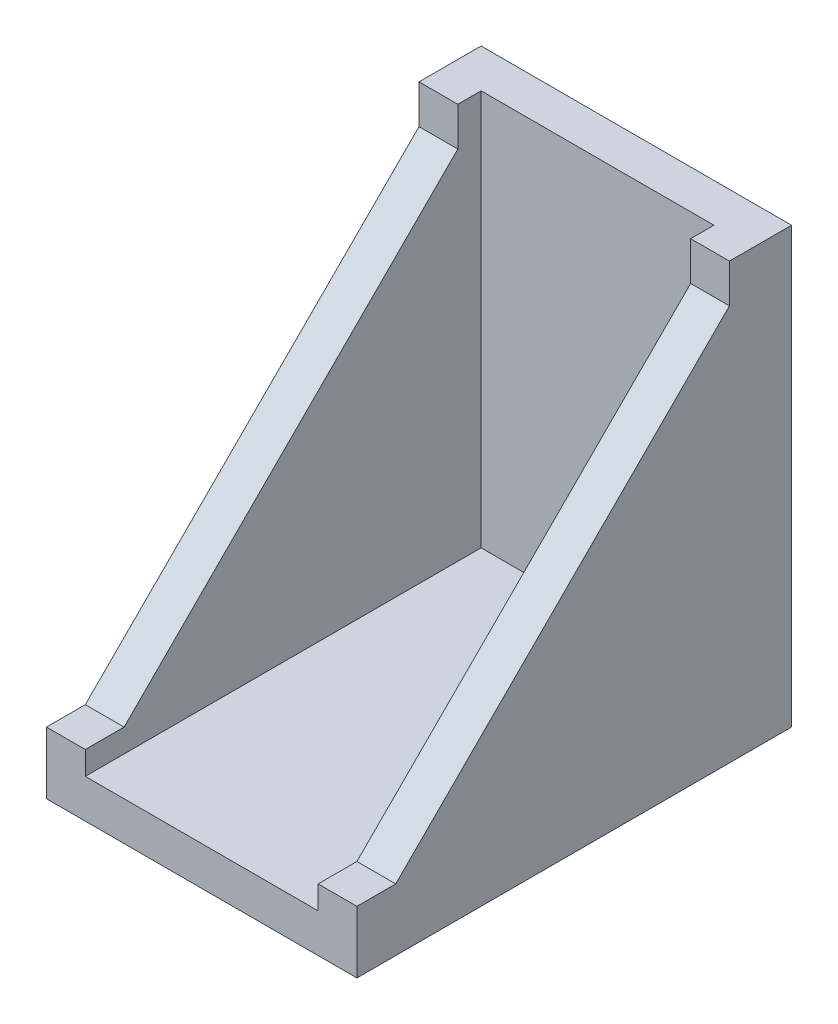
ISO-10303-21;
HEADER;
FILE_DESCRIPTION(('STEP AP214'),'2;1');
FILE_NAME('part.step','',(''),(''),'','','');
FILE_SCHEMA(('AUTOMOTIVE_DESIGN { 1 0 10303 214 1 1 1 1 }'));
ENDSEC;
DATA;
#1=APPLICATION_CONTEXT('core data for automotive mechanical design processes');
#2=APPLICATION_PROTOCOL_DEFINITION('international standard','automotive_design',2000,#1);
#3=PRODUCT_CONTEXT('',#1,'mechanical');
#4=PRODUCT('Part','Part','',(#3));
#5=PRODUCT_RELATED_PRODUCT_CATEGORY('part','',(#4));
#6=PRODUCT_DEFINITION_FORMATION('','',#4);
#7=PRODUCT_DEFINITION_CONTEXT('part definition',#1,'design');
#8=PRODUCT_DEFINITION('design','',#6,#7);
#9=PRODUCT_DEFINITION_SHAPE('','',#8);
#10=(LENGTH_UNIT() NAMED_UNIT(*) SI_UNIT(.MILLI.,.METRE.));
#11=(NAMED_UNIT(*) PLANE_ANGLE_UNIT() SI_UNIT($,.RADIAN.));
#12=(NAMED_UNIT(*) SI_UNIT($,.STERADIAN.) SOLID_ANGLE_UNIT());
#13=UNCERTAINTY_MEASURE_WITH_UNIT(LENGTH_MEASURE(1.E-05),#10,'distance_accuracy_value','');
#14=(GEOMETRIC_REPRESENTATION_CONTEXT(3) GLOBAL_UNCERTAINTY_ASSIGNED_CONTEXT((#13)) GLOBAL_UNIT_ASSIGNED_CONTEXT((#10,
#11,#12)) REPRESENTATION_CONTEXT('',''));
#15=CARTESIAN_POINT('',(0.,0.,0.));
#16=DIRECTION('',(0.,0.,1.));
#17=DIRECTION('',(1.,0.,0.));
#18=AXIS2_PLACEMENT_3D('',#15,#16,#17);
#19=CARTESIAN_POINT('',(0.,28.,0.));
#20=DIRECTION('',(1.,0.,0.));
#21=DIRECTION('',(0.,0.,-1.));
#22=AXIS2_PLACEMENT_3D('',#19,#20,#21);
#23=PLANE('',#22);
#24=DIRECTION('',(0.,1.,0.));
#25=VECTOR('',#24,1.);
#26=CARTESIAN_POINT('',(0.,28.,4.));
#27=LINE('',#26,#25);
#28=CARTESIAN_POINT('',(0.,25.5,4.));
#29=VERTEX_POINT('',#28);
#30=CARTESIAN_POINT('',(0.,28.,4.));
#31=VERTEX_POINT('',#30);
#32=EDGE_CURVE('E229',#29,#31,#27,.T.);
#33=ORIENTED_EDGE('',*,*,#32,.T.);
#34=DIRECTION('',(0.,0.,1.));
#35=VECTOR('',#34,1.);
#36=CARTESIAN_POINT('',(0.,28.,0.));
#37=LINE('',#36,#35);
#38=CARTESIAN_POINT('',(0.,28.,0.));
#39=VERTEX_POINT('',#38);
#40=EDGE_CURVE('E159',#39,#31,#37,.T.);
#41=ORIENTED_EDGE('',*,*,#40,.F.);
#42=DIRECTION('',(0.,-1.,0.));
#43=VECTOR('',#42,1.);
#44=CARTESIAN_POINT('',(0.,28.,0.));
#45=LINE('',#44,#43);
#46=CARTESIAN_POINT('',(0.,0.,0.));
#47=VERTEX_POINT('',#46);
#48=EDGE_CURVE('E192',#39,#47,#45,.T.);
#49=ORIENTED_EDGE('',*,*,#48,.T.);
#50=DIRECTION('',(0.,0.,1.));
#51=VECTOR('',#50,1.);
#52=CARTESIAN_POINT('',(0.,0.,0.));
#53=LINE('',#52,#51);
#54=CARTESIAN_POINT('',(0.,0.,28.));
#55=VERTEX_POINT('',#54);
#56=EDGE_CURVE('E176',#47,#55,#53,.T.);
#57=ORIENTED_EDGE('',*,*,#56,.T.);
#58=DIRECTION('',(0.,-1.,0.));
#59=VECTOR('',#58,1.);
#60=CARTESIAN_POINT('',(0.,28.,28.));
#61=LINE('',#60,#59);
#62=CARTESIAN_POINT('',(0.,4.,28.));
#63=VERTEX_POINT('',#62);
#64=EDGE_CURVE('E11',#63,#55,#61,.T.);
#65=ORIENTED_EDGE('',*,*,#64,.F.);
#66=DIRECTION('',(0.,0.,-1.));
#67=VECTOR('',#66,1.);
#68=CARTESIAN_POINT('',(0.,4.,25.5000000000001));
#69=LINE('',#68,#67);
#70=CARTESIAN_POINT('',(0.,4.,25.5000000000001));
#71=VERTEX_POINT('',#70);
#72=EDGE_CURVE('E149',#63,#71,#69,.T.);
#73=ORIENTED_EDGE('',*,*,#72,.T.);
#74=DIRECTION('',(0.,0.707106781186546,-0.707106781186549));
#75=VECTOR('',#74,1.);
#76=CARTESIAN_POINT('',(0.,25.5,4.));
#77=LINE('',#76,#75);
#78=EDGE_CURVE('E231',#71,#29,#77,.T.);
#79=ORIENTED_EDGE('',*,*,#78,.T.);
#80=EDGE_LOOP('',(#33,#41,#49,#57,#65,#73,#79));
#81=FACE_BOUND('',#80,.T.);
#82=ADVANCED_FACE('F39',(#81),#23,.F.);
#83=CARTESIAN_POINT('',(0.,28.,28.));
#84=DIRECTION('',(0.,0.,-1.));
#85=DIRECTION('',(-1.,0.,0.));
#86=AXIS2_PLACEMENT_3D('',#83,#84,#85);
#87=PLANE('',#86);
#88=DIRECTION('',(1.,0.,0.));
#89=VECTOR('',#88,1.);
#90=CARTESIAN_POINT('',(-0.000999999999999265,4.,28.));
#91=LINE('',#90,#89);
#92=CARTESIAN_POINT('',(2.5,4.,28.));
#93=VERTEX_POINT('',#92);
#94=EDGE_CURVE('E53',#63,#93,#91,.T.);
#95=ORIENTED_EDGE('',*,*,#94,.F.);
#96=ORIENTED_EDGE('',*,*,#64,.T.);
#97=DIRECTION('',(1.,0.,0.));
#98=VECTOR('',#97,1.);
#99=CARTESIAN_POINT('',(0.,0.,28.));
#100=LINE('',#99,#98);
#101=CARTESIAN_POINT('',(20.,0.,28.));
#102=VERTEX_POINT('',#101);
#103=EDGE_CURVE('E195',#55,#102,#100,.T.);
#104=ORIENTED_EDGE('',*,*,#103,.T.);
#105=DIRECTION('',(0.,-1.,0.));
#106=VECTOR('',#105,1.);
#107=CARTESIAN_POINT('',(20.,28.,28.));
#108=LINE('',#107,#106);
#109=CARTESIAN_POINT('',(20.,4.,28.));
#110=VERTEX_POINT('',#109);
#111=EDGE_CURVE('E46',#110,#102,#108,.T.);
#112=ORIENTED_EDGE('',*,*,#111,.F.);
#113=DIRECTION('',(-1.,0.,0.));
#114=VECTOR('',#113,1.);
#115=CARTESIAN_POINT('',(20.001,4.,28.));
#116=LINE('',#115,#114);
#117=CARTESIAN_POINT('',(17.5,4.,28.));
#118=VERTEX_POINT('',#117);
#119=EDGE_CURVE('E245',#110,#118,#116,.T.);
#120=ORIENTED_EDGE('',*,*,#119,.T.);
#121=DIRECTION('',(0.,1.,0.));
#122=VECTOR('',#121,1.);
#123=CARTESIAN_POINT('',(17.5,2.5,28.));
#124=LINE('',#123,#122);
#125=CARTESIAN_POINT('',(17.5,2.5,28.));
#126=VERTEX_POINT('',#125);
#127=EDGE_CURVE('E180',#126,#118,#124,.T.);
#128=ORIENTED_EDGE('',*,*,#127,.F.);
#129=DIRECTION('',(1.,0.,0.));
#130=VECTOR('',#129,1.);
#131=CARTESIAN_POINT('',(2.5,2.5,28.));
#132=LINE('',#131,#130);
#133=CARTESIAN_POINT('',(2.5,2.5,28.));
#134=VERTEX_POINT('',#133);
#135=EDGE_CURVE('E264',#134,#126,#132,.T.);
#136=ORIENTED_EDGE('',*,*,#135,.F.);
#137=DIRECTION('',(0.,1.,0.));
#138=VECTOR('',#137,1.);
#139=CARTESIAN_POINT('',(2.5,2.5,28.));
#140=LINE('',#139,#138);
#141=EDGE_CURVE('E183',#134,#93,#140,.T.);
#142=ORIENTED_EDGE('',*,*,#141,.T.);
#143=EDGE_LOOP('',(#95,#96,#104,#112,#120,#128,#136,#142));
#144=FACE_BOUND('',#143,.T.);
#145=ADVANCED_FACE('F217',(#144),#87,.F.);
#146=CARTESIAN_POINT('',(0.,28.,0.));
#147=DIRECTION('',(0.,1.,0.));
#148=DIRECTION('',(0.,0.,1.));
#149=AXIS2_PLACEMENT_3D('',#146,#147,#148);
#150=PLANE('',#149);
#151=ORIENTED_EDGE('',*,*,#40,.T.);
#152=DIRECTION('',(1.,0.,0.));
#153=VECTOR('',#152,1.);
#154=CARTESIAN_POINT('',(-0.000999999999999265,28.,4.));
#155=LINE('',#154,#153);
#156=CARTESIAN_POINT('',(2.5,28.,4.));
#157=VERTEX_POINT('',#156);
#158=EDGE_CURVE('E142',#31,#157,#155,.T.);
#159=ORIENTED_EDGE('',*,*,#158,.T.);
#160=DIRECTION('',(0.,0.,1.));
#161=VECTOR('',#160,1.);
#162=CARTESIAN_POINT('',(2.5,28.,28.));
#163=LINE('',#162,#161);
#164=CARTESIAN_POINT('',(2.5,28.,2.5));
#165=VERTEX_POINT('',#164);
#166=EDGE_CURVE('E157',#165,#157,#163,.T.);
#167=ORIENTED_EDGE('',*,*,#166,.F.);
#168=DIRECTION('',(-1.,0.,0.));
#169=VECTOR('',#168,1.);
#170=CARTESIAN_POINT('',(2.5,28.,2.5));
#171=LINE('',#170,#169);
#172=CARTESIAN_POINT('',(17.5,28.,2.5));
#173=VERTEX_POINT('',#172);
#174=EDGE_CURVE('E167',#173,#165,#171,.T.);
#175=ORIENTED_EDGE('',*,*,#174,.F.);
#176=DIRECTION('',(0.,0.,-1.));
#177=VECTOR('',#176,1.);
#178=CARTESIAN_POINT('',(17.5,28.,28.));
#179=LINE('',#178,#177);
#180=CARTESIAN_POINT('',(17.5,28.,4.));
#181=VERTEX_POINT('',#180);
#182=EDGE_CURVE('E165',#181,#173,#179,.T.);
#183=ORIENTED_EDGE('',*,*,#182,.F.);
#184=DIRECTION('',(-1.,0.,0.));
#185=VECTOR('',#184,1.);
#186=CARTESIAN_POINT('',(20.001,28.,4.));
#187=LINE('',#186,#185);
#188=CARTESIAN_POINT('',(20.,28.,4.));
#189=VERTEX_POINT('',#188);
#190=EDGE_CURVE('E61',#189,#181,#187,.T.);
#191=ORIENTED_EDGE('',*,*,#190,.F.);
#192=DIRECTION('',(0.,0.,-1.));
#193=VECTOR('',#192,1.);
#194=CARTESIAN_POINT('',(20.,28.,0.));
#195=LINE('',#194,#193);
#196=CARTESIAN_POINT('',(20.,28.,0.));
#197=VERTEX_POINT('',#196);
#198=EDGE_CURVE('E187',#189,#197,#195,.T.);
#199=ORIENTED_EDGE('',*,*,#198,.T.);
#200=DIRECTION('',(-1.,0.,0.));
#201=VECTOR('',#200,1.);
#202=CARTESIAN_POINT('',(0.,28.,0.));
#203=LINE('',#202,#201);
#204=EDGE_CURVE('E190',#197,#39,#203,.T.);
#205=ORIENTED_EDGE('',*,*,#204,.T.);
#206=EDGE_LOOP('',(#151,#159,#167,#175,#183,#191,#199,#205));
#207=FACE_BOUND('',#206,.T.);
#208=ADVANCED_FACE('F155',(#207),#150,.T.);
#209=CARTESIAN_POINT('',(2.5,2.5,28.));
#210=DIRECTION('',(-1.,0.,0.));
#211=DIRECTION('',(0.,0.,1.));
#212=AXIS2_PLACEMENT_3D('',#209,#210,#211);
#213=PLANE('',#212);
#214=DIRECTION('',(0.,-1.,0.));
#215=VECTOR('',#214,1.);
#216=CARTESIAN_POINT('',(2.5,28.,4.));
#217=LINE('',#216,#215);
#218=CARTESIAN_POINT('',(2.5,25.5,4.));
#219=VERTEX_POINT('',#218);
#220=EDGE_CURVE('E139',#157,#219,#217,.T.);
#221=ORIENTED_EDGE('',*,*,#220,.T.);
#222=DIRECTION('',(0.,-0.707106781186546,0.707106781186549));
#223=VECTOR('',#222,1.);
#224=CARTESIAN_POINT('',(2.5,25.5,4.));
#225=LINE('',#224,#223);
#226=CARTESIAN_POINT('',(2.5,4.,25.5000000000001));
#227=VERTEX_POINT('',#226);
#228=EDGE_CURVE('E150',#219,#227,#225,.T.);
#229=ORIENTED_EDGE('',*,*,#228,.T.);
#230=DIRECTION('',(0.,0.,1.));
#231=VECTOR('',#230,1.);
#232=CARTESIAN_POINT('',(2.5,4.,25.5000000000001));
#233=LINE('',#232,#231);
#234=EDGE_CURVE('E261',#227,#93,#233,.T.);
#235=ORIENTED_EDGE('',*,*,#234,.T.);
#236=ORIENTED_EDGE('',*,*,#141,.F.);
#237=DIRECTION('',(0.,0.,1.));
#238=VECTOR('',#237,1.);
#239=CARTESIAN_POINT('',(2.5,2.5,28.));
#240=LINE('',#239,#238);
#241=CARTESIAN_POINT('',(2.5,2.5,2.5));
#242=VERTEX_POINT('',#241);
#243=EDGE_CURVE('E174',#242,#134,#240,.T.);
#244=ORIENTED_EDGE('',*,*,#243,.F.);
#245=DIRECTION('',(0.,1.,0.));
#246=VECTOR('',#245,1.);
#247=CARTESIAN_POINT('',(2.5,2.5,2.5));
#248=LINE('',#247,#246);
#249=EDGE_CURVE('E163',#242,#165,#248,.T.);
#250=ORIENTED_EDGE('',*,*,#249,.T.);
#251=ORIENTED_EDGE('',*,*,#166,.T.);
#252=EDGE_LOOP('',(#221,#229,#235,#236,#244,#250,#251));
#253=FACE_BOUND('',#252,.T.);
#254=ADVANCED_FACE('F161',(#253),#213,.F.);
#255=CARTESIAN_POINT('',(20.,28.,0.));
#256=DIRECTION('',(-1.,0.,0.));
#257=DIRECTION('',(0.,0.,1.));
#258=AXIS2_PLACEMENT_3D('',#255,#256,#257);
#259=PLANE('',#258);
#260=DIRECTION('',(0.,0.707106781186546,-0.707106781186549));
#261=VECTOR('',#260,1.);
#262=CARTESIAN_POINT('',(20.,25.5,4.));
#263=LINE('',#262,#261);
#264=CARTESIAN_POINT('',(20.,4.,25.5000000000001));
#265=VERTEX_POINT('',#264);
#266=CARTESIAN_POINT('',(20.,25.5,4.));
#267=VERTEX_POINT('',#266);
#268=EDGE_CURVE('E253',#265,#267,#263,.T.);
#269=ORIENTED_EDGE('',*,*,#268,.F.);
#270=DIRECTION('',(0.,0.,-1.));
#271=VECTOR('',#270,1.);
#272=CARTESIAN_POINT('',(20.,4.,25.5000000000001));
#273=LINE('',#272,#271);
#274=EDGE_CURVE('E213',#110,#265,#273,.T.);
#275=ORIENTED_EDGE('',*,*,#274,.F.);
#276=ORIENTED_EDGE('',*,*,#111,.T.);
#277=DIRECTION('',(0.,0.,-1.));
#278=VECTOR('',#277,1.);
#279=CARTESIAN_POINT('',(20.,0.,0.));
#280=LINE('',#279,#278);
#281=CARTESIAN_POINT('',(20.,0.,0.));
#282=VERTEX_POINT('',#281);
#283=EDGE_CURVE('E198',#102,#282,#280,.T.);
#284=ORIENTED_EDGE('',*,*,#283,.T.);
#285=DIRECTION('',(0.,-1.,0.));
#286=VECTOR('',#285,1.);
#287=CARTESIAN_POINT('',(20.,28.,0.));
#288=LINE('',#287,#286);
#289=EDGE_CURVE('E203',#197,#282,#288,.T.);
#290=ORIENTED_EDGE('',*,*,#289,.F.);
#291=ORIENTED_EDGE('',*,*,#198,.F.);
#292=DIRECTION('',(0.,1.,0.));
#293=VECTOR('',#292,1.);
#294=CARTESIAN_POINT('',(20.,28.,4.));
#295=LINE('',#294,#293);
#296=EDGE_CURVE('E241',#267,#189,#295,.T.);
#297=ORIENTED_EDGE('',*,*,#296,.F.);
#298=EDGE_LOOP('',(#269,#275,#276,#284,#290,#291,#297));
#299=FACE_BOUND('',#298,.T.);
#300=ADVANCED_FACE('F209',(#299),#259,.F.);
#301=CARTESIAN_POINT('',(0.,28.,0.));
#302=DIRECTION('',(0.,0.,1.));
#303=DIRECTION('',(1.,0.,0.));
#304=AXIS2_PLACEMENT_3D('',#301,#302,#303);
#305=PLANE('',#304);
#306=DIRECTION('',(-1.,0.,0.));
#307=VECTOR('',#306,1.);
#308=CARTESIAN_POINT('',(0.,0.,0.));
#309=LINE('',#308,#307);
#310=EDGE_CURVE('E188',#282,#47,#309,.T.);
#311=ORIENTED_EDGE('',*,*,#310,.T.);
#312=ORIENTED_EDGE('',*,*,#48,.F.);
#313=ORIENTED_EDGE('',*,*,#204,.F.);
#314=ORIENTED_EDGE('',*,*,#289,.T.);
#315=EDGE_LOOP('',(#311,#312,#313,#314));
#316=FACE_BOUND('',#315,.T.);
#317=ADVANCED_FACE('F225',(#316),#305,.F.);
#318=CARTESIAN_POINT('',(0.,0.,0.));
#319=DIRECTION('',(0.,1.,0.));
#320=DIRECTION('',(0.,0.,1.));
#321=AXIS2_PLACEMENT_3D('',#318,#319,#320);
#322=PLANE('',#321);
#323=ORIENTED_EDGE('',*,*,#56,.F.);
#324=ORIENTED_EDGE('',*,*,#310,.F.);
#325=ORIENTED_EDGE('',*,*,#283,.F.);
#326=ORIENTED_EDGE('',*,*,#103,.F.);
#327=EDGE_LOOP('',(#323,#324,#325,#326));
#328=FACE_BOUND('',#327,.T.);
#329=ADVANCED_FACE('F222',(#328),#322,.F.);
#330=CARTESIAN_POINT('',(2.5,2.5,2.5));
#331=DIRECTION('',(0.,0.,-1.));
#332=DIRECTION('',(-1.,0.,0.));
#333=AXIS2_PLACEMENT_3D('',#330,#331,#332);
#334=PLANE('',#333);
#335=ORIENTED_EDGE('',*,*,#174,.T.);
#336=ORIENTED_EDGE('',*,*,#249,.F.);
#337=DIRECTION('',(-1.,0.,0.));
#338=VECTOR('',#337,1.);
#339=CARTESIAN_POINT('',(2.5,2.5,2.5));
#340=LINE('',#339,#338);
#341=CARTESIAN_POINT('',(17.5,2.5,2.5));
#342=VERTEX_POINT('',#341);
#343=EDGE_CURVE('E170',#342,#242,#340,.T.);
#344=ORIENTED_EDGE('',*,*,#343,.F.);
#345=DIRECTION('',(0.,1.,0.));
#346=VECTOR('',#345,1.);
#347=CARTESIAN_POINT('',(17.5,2.5,2.5));
#348=LINE('',#347,#346);
#349=EDGE_CURVE('E177',#342,#173,#348,.T.);
#350=ORIENTED_EDGE('',*,*,#349,.T.);
#351=EDGE_LOOP('',(#335,#336,#344,#350));
#352=FACE_BOUND('',#351,.T.);
#353=ADVANCED_FACE('F274',(#352),#334,.F.);
#354=CARTESIAN_POINT('',(17.5,2.5,28.));
#355=DIRECTION('',(1.,0.,0.));
#356=DIRECTION('',(0.,0.,-1.));
#357=AXIS2_PLACEMENT_3D('',#354,#355,#356);
#358=PLANE('',#357);
#359=ORIENTED_EDGE('',*,*,#127,.T.);
#360=DIRECTION('',(0.,0.,1.));
#361=VECTOR('',#360,1.);
#362=CARTESIAN_POINT('',(17.5,4.,25.5000000000001));
#363=LINE('',#362,#361);
#364=CARTESIAN_POINT('',(17.5,4.,25.5000000000001));
#365=VERTEX_POINT('',#364);
#366=EDGE_CURVE('E256',#365,#118,#363,.T.);
#367=ORIENTED_EDGE('',*,*,#366,.F.);
#368=DIRECTION('',(0.,-0.707106781186546,0.707106781186549));
#369=VECTOR('',#368,1.);
#370=CARTESIAN_POINT('',(17.5,25.5,4.));
#371=LINE('',#370,#369);
#372=CARTESIAN_POINT('',(17.5,25.5,4.));
#373=VERTEX_POINT('',#372);
#374=EDGE_CURVE('E258',#373,#365,#371,.T.);
#375=ORIENTED_EDGE('',*,*,#374,.F.);
#376=DIRECTION('',(0.,-1.,0.));
#377=VECTOR('',#376,1.);
#378=CARTESIAN_POINT('',(17.5,28.,4.));
#379=LINE('',#378,#377);
#380=EDGE_CURVE('E243',#181,#373,#379,.T.);
#381=ORIENTED_EDGE('',*,*,#380,.F.);
#382=ORIENTED_EDGE('',*,*,#182,.T.);
#383=ORIENTED_EDGE('',*,*,#349,.F.);
#384=DIRECTION('',(0.,0.,-1.));
#385=VECTOR('',#384,1.);
#386=CARTESIAN_POINT('',(17.5,2.5,28.));
#387=LINE('',#386,#385);
#388=EDGE_CURVE('E266',#126,#342,#387,.T.);
#389=ORIENTED_EDGE('',*,*,#388,.F.);
#390=EDGE_LOOP('',(#359,#367,#375,#381,#382,#383,#389));
#391=FACE_BOUND('',#390,.T.);
#392=ADVANCED_FACE('F278',(#391),#358,.F.);
#393=CARTESIAN_POINT('',(0.,2.5,0.));
#394=DIRECTION('',(0.,-1.,0.));
#395=DIRECTION('',(0.,0.,-1.));
#396=AXIS2_PLACEMENT_3D('',#393,#394,#395);
#397=PLANE('',#396);
#398=ORIENTED_EDGE('',*,*,#243,.T.);
#399=ORIENTED_EDGE('',*,*,#135,.T.);
#400=ORIENTED_EDGE('',*,*,#388,.T.);
#401=ORIENTED_EDGE('',*,*,#343,.T.);
#402=EDGE_LOOP('',(#398,#399,#400,#401));
#403=FACE_BOUND('',#402,.T.);
#404=ADVANCED_FACE('F271',(#403),#397,.F.);
#405=CARTESIAN_POINT('',(20.001,4.,25.5000000000001));
#406=DIRECTION('',(0.,-1.,0.));
#407=DIRECTION('',(0.,0.,-1.));
#408=AXIS2_PLACEMENT_3D('',#405,#406,#407);
#409=PLANE('',#408);
#410=ORIENTED_EDGE('',*,*,#274,.T.);
#411=DIRECTION('',(-1.,0.,0.));
#412=VECTOR('',#411,1.);
#413=CARTESIAN_POINT('',(20.001,4.,25.5000000000001));
#414=LINE('',#413,#412);
#415=EDGE_CURVE('E249',#265,#365,#414,.T.);
#416=ORIENTED_EDGE('',*,*,#415,.T.);
#417=ORIENTED_EDGE('',*,*,#366,.T.);
#418=ORIENTED_EDGE('',*,*,#119,.F.);
#419=EDGE_LOOP('',(#410,#416,#417,#418));
#420=FACE_BOUND('',#419,.T.);
#421=ADVANCED_FACE('F287',(#420),#409,.F.);
#422=CARTESIAN_POINT('',(20.001,25.5,4.));
#423=DIRECTION('',(0.,-0.707106781186549,-0.707106781186546));
#424=DIRECTION('',(0.,0.707106781186546,-0.707106781186549));
#425=AXIS2_PLACEMENT_3D('',#422,#423,#424);
#426=PLANE('',#425);
#427=ORIENTED_EDGE('',*,*,#268,.T.);
#428=DIRECTION('',(-1.,0.,0.));
#429=VECTOR('',#428,1.);
#430=CARTESIAN_POINT('',(20.001,25.5,4.));
#431=LINE('',#430,#429);
#432=EDGE_CURVE('E247',#267,#373,#431,.T.);
#433=ORIENTED_EDGE('',*,*,#432,.T.);
#434=ORIENTED_EDGE('',*,*,#374,.T.);
#435=ORIENTED_EDGE('',*,*,#415,.F.);
#436=EDGE_LOOP('',(#427,#433,#434,#435));
#437=FACE_BOUND('',#436,.T.);
#438=ADVANCED_FACE('F285',(#437),#426,.F.);
#439=CARTESIAN_POINT('',(20.001,28.,4.));
#440=DIRECTION('',(0.,0.,-1.));
#441=DIRECTION('',(-1.,0.,0.));
#442=AXIS2_PLACEMENT_3D('',#439,#440,#441);
#443=PLANE('',#442);
#444=ORIENTED_EDGE('',*,*,#296,.T.);
#445=ORIENTED_EDGE('',*,*,#190,.T.);
#446=ORIENTED_EDGE('',*,*,#380,.T.);
#447=ORIENTED_EDGE('',*,*,#432,.F.);
#448=EDGE_LOOP('',(#444,#445,#446,#447));
#449=FACE_BOUND('',#448,.T.);
#450=ADVANCED_FACE('F283',(#449),#443,.F.);
#451=CARTESIAN_POINT('',(-0.000999999999999265,28.,4.));
#452=DIRECTION('',(0.,0.,1.));
#453=DIRECTION('',(1.,0.,0.));
#454=AXIS2_PLACEMENT_3D('',#451,#452,#453);
#455=PLANE('',#454);
#456=DIRECTION('',(1.,0.,0.));
#457=VECTOR('',#456,1.);
#458=CARTESIAN_POINT('',(-0.000999999999999265,25.5,4.));
#459=LINE('',#458,#457);
#460=EDGE_CURVE('E145',#29,#219,#459,.T.);
#461=ORIENTED_EDGE('',*,*,#460,.T.);
#462=ORIENTED_EDGE('',*,*,#220,.F.);
#463=ORIENTED_EDGE('',*,*,#158,.F.);
#464=ORIENTED_EDGE('',*,*,#32,.F.);
#465=EDGE_LOOP('',(#461,#462,#463,#464));
#466=FACE_BOUND('',#465,.T.);
#467=ADVANCED_FACE('F141',(#466),#455,.T.);
#468=CARTESIAN_POINT('',(-0.000999999999999265,25.5,4.));
#469=DIRECTION('',(0.,0.707106781186549,0.707106781186546));
#470=DIRECTION('',(0.,-0.707106781186546,0.707106781186549));
#471=AXIS2_PLACEMENT_3D('',#468,#469,#470);
#472=PLANE('',#471);
#473=DIRECTION('',(1.,0.,0.));
#474=VECTOR('',#473,1.);
#475=CARTESIAN_POINT('',(-0.000999999999999265,4.,25.5000000000001));
#476=LINE('',#475,#474);
#477=EDGE_CURVE('E233',#71,#227,#476,.T.);
#478=ORIENTED_EDGE('',*,*,#477,.T.);
#479=ORIENTED_EDGE('',*,*,#228,.F.);
#480=ORIENTED_EDGE('',*,*,#460,.F.);
#481=ORIENTED_EDGE('',*,*,#78,.F.);
#482=EDGE_LOOP('',(#478,#479,#480,#481));
#483=FACE_BOUND('',#482,.T.);
#484=ADVANCED_FACE('F375',(#483),#472,.T.);
#485=CARTESIAN_POINT('',(-0.000999999999999265,4.,25.5000000000001));
#486=DIRECTION('',(0.,1.,0.));
#487=DIRECTION('',(0.,0.,1.));
#488=AXIS2_PLACEMENT_3D('',#485,#486,#487);
#489=PLANE('',#488);
#490=ORIENTED_EDGE('',*,*,#94,.T.);
#491=ORIENTED_EDGE('',*,*,#234,.F.);
#492=ORIENTED_EDGE('',*,*,#477,.F.);
#493=ORIENTED_EDGE('',*,*,#72,.F.);
#494=EDGE_LOOP('',(#490,#491,#492,#493));
#495=FACE_BOUND('',#494,.T.);
#496=ADVANCED_FACE('F384',(#495),#489,.T.);
#497=CLOSED_SHELL('',(#82,#145,#208,#254,#300,#317,#329,#353,#392,#404,#421,#438,#450,#467,#484,#496));
#498=MANIFOLD_SOLID_BREP('B2',#497);
#499=ADVANCED_BREP_SHAPE_REPRESENTATION('',(#18,#498),#14);
#500=SHAPE_DEFINITION_REPRESENTATION(#9,#499);
ENDSEC;
END-ISO-10303-21;
